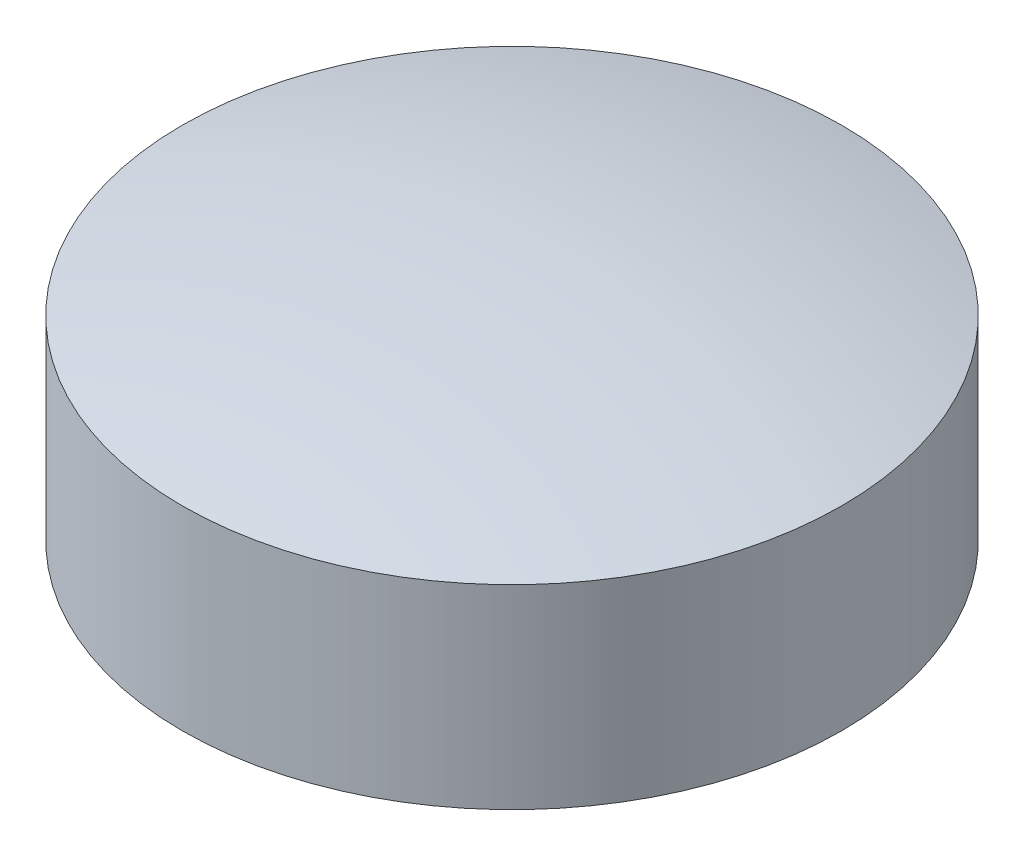
ISO-10303-21;
HEADER;
FILE_DESCRIPTION(('STEP AP214'),'2;1');
FILE_NAME('part.step','',(''),(''),'','','');
FILE_SCHEMA(('AUTOMOTIVE_DESIGN { 1 0 10303 214 1 1 1 1 }'));
ENDSEC;
DATA;
#1=APPLICATION_CONTEXT('core data for automotive mechanical design processes');
#2=APPLICATION_PROTOCOL_DEFINITION('international standard','automotive_design',2000,#1);
#3=PRODUCT_CONTEXT('',#1,'mechanical');
#4=PRODUCT('Part','Part','',(#3));
#5=PRODUCT_RELATED_PRODUCT_CATEGORY('part','',(#4));
#6=PRODUCT_DEFINITION_FORMATION('','',#4);
#7=PRODUCT_DEFINITION_CONTEXT('part definition',#1,'design');
#8=PRODUCT_DEFINITION('design','',#6,#7);
#9=PRODUCT_DEFINITION_SHAPE('','',#8);
#10=(LENGTH_UNIT() NAMED_UNIT(*) SI_UNIT(.MILLI.,.METRE.));
#11=(NAMED_UNIT(*) PLANE_ANGLE_UNIT() SI_UNIT($,.RADIAN.));
#12=(NAMED_UNIT(*) SI_UNIT($,.STERADIAN.) SOLID_ANGLE_UNIT());
#13=UNCERTAINTY_MEASURE_WITH_UNIT(LENGTH_MEASURE(1.E-05),#10,'distance_accuracy_value','');
#14=(GEOMETRIC_REPRESENTATION_CONTEXT(3) GLOBAL_UNCERTAINTY_ASSIGNED_CONTEXT((#13)) GLOBAL_UNIT_ASSIGNED_CONTEXT((#10,
#11,#12)) REPRESENTATION_CONTEXT('',''));
#15=CARTESIAN_POINT('',(0.,0.,0.));
#16=DIRECTION('',(0.,0.,1.));
#17=DIRECTION('',(1.,0.,0.));
#18=AXIS2_PLACEMENT_3D('',#15,#16,#17);
#19=CARTESIAN_POINT('',(0.,0.,0.));
#20=DIRECTION('',(0.,-1.,0.));
#21=DIRECTION('',(0.,0.,-1.));
#22=AXIS2_PLACEMENT_3D('',#19,#20,#21);
#23=CYLINDRICAL_SURFACE('',#22,22.);
#24=CARTESIAN_POINT('',(0.,13.,0.));
#25=DIRECTION('',(0.,-1.,0.));
#26=DIRECTION('',(0.,0.,-1.));
#27=AXIS2_PLACEMENT_3D('',#24,#25,#26);
#28=CIRCLE('',#27,22.);
#29=CARTESIAN_POINT('',(0.,13.,-22.));
#30=VERTEX_POINT('',#29);
#31=EDGE_CURVE('E57',#30,#30,#28,.T.);
#32=ORIENTED_EDGE('',*,*,#31,.T.);
#33=EDGE_LOOP('',(#32));
#34=FACE_BOUND('',#33,.T.);
#35=CARTESIAN_POINT('',(0.,0.,0.));
#36=DIRECTION('',(0.,-1.,0.));
#37=DIRECTION('',(0.,0.,-1.));
#38=AXIS2_PLACEMENT_3D('',#35,#36,#37);
#39=CIRCLE('',#38,22.);
#40=CARTESIAN_POINT('',(-21.9488636363636,0.,-1.49912810403717));
#41=VERTEX_POINT('',#40);
#42=CARTESIAN_POINT('',(-21.9488636363636,0.,1.49912810403716));
#43=VERTEX_POINT('',#42);
#44=EDGE_CURVE('E85',#41,#43,#39,.T.);
#45=ORIENTED_EDGE('',*,*,#44,.F.);
#46=DIRECTION('',(0.,-1.,0.));
#47=VECTOR('',#46,1.);
#48=CARTESIAN_POINT('',(-21.9488636363636,5.,-1.49912810403716));
#49=LINE('',#48,#47);
#50=CARTESIAN_POINT('',(-21.9488636363636,10.,-1.49912810403716));
#51=VERTEX_POINT('',#50);
#52=EDGE_CURVE('E64',#41,#51,#49,.F.);
#53=ORIENTED_EDGE('',*,*,#52,.T.);
#54=CARTESIAN_POINT('',(0.,10.,0.));
#55=DIRECTION('',(0.,1.,0.));
#56=DIRECTION('',(0.,0.,1.));
#57=AXIS2_PLACEMENT_3D('',#54,#55,#56);
#58=CIRCLE('',#57,22.);
#59=CARTESIAN_POINT('',(-21.9488636363636,10.,1.49912810403716));
#60=VERTEX_POINT('',#59);
#61=EDGE_CURVE('E13',#60,#51,#58,.F.);
#62=ORIENTED_EDGE('',*,*,#61,.F.);
#63=DIRECTION('',(0.,-1.,0.));
#64=VECTOR('',#63,1.);
#65=CARTESIAN_POINT('',(-21.9488636363636,5.,1.49912810403716));
#66=LINE('',#65,#64);
#67=EDGE_CURVE('E73',#60,#43,#66,.T.);
#68=ORIENTED_EDGE('',*,*,#67,.T.);
#69=EDGE_LOOP('',(#45,#53,#62,#68));
#70=FACE_BOUND('',#69,.T.);
#71=ADVANCED_FACE('F49',(#34,#70),#23,.T.);
#72=CARTESIAN_POINT('',(0.,-66.1666666666667,0.));
#73=DIRECTION('',(0.,-1.,0.));
#74=DIRECTION('',(1.,0.,0.));
#75=AXIS2_PLACEMENT_3D('',#72,#73,#74);
#76=SPHERICAL_SURFACE('',#75,82.1666666666667);
#77=ORIENTED_EDGE('',*,*,#31,.F.);
#78=EDGE_LOOP('',(#77));
#79=FACE_BOUND('',#78,.T.);
#80=ADVANCED_FACE('F51',(#79),#76,.T.);
#81=CARTESIAN_POINT('',(0.,0.,0.));
#82=DIRECTION('',(0.,-1.,0.));
#83=DIRECTION('',(0.,0.,-1.));
#84=AXIS2_PLACEMENT_3D('',#81,#82,#83);
#85=PLANE('',#84);
#86=ORIENTED_EDGE('',*,*,#44,.T.);
#87=CARTESIAN_POINT('',(-22.,0.,0.));
#88=DIRECTION('',(0.,1.,0.));
#89=DIRECTION('',(0.,0.,1.));
#90=AXIS2_PLACEMENT_3D('',#87,#88,#89);
#91=CIRCLE('',#90,1.5);
#92=EDGE_CURVE('E68',#43,#41,#91,.T.);
#93=ORIENTED_EDGE('',*,*,#92,.T.);
#94=EDGE_LOOP('',(#86,#93));
#95=FACE_BOUND('',#94,.T.);
#96=ADVANCED_FACE('F94',(#95),#85,.T.);
#97=CARTESIAN_POINT('',(-22.,10.,0.));
#98=DIRECTION('',(0.,-1.,0.));
#99=DIRECTION('',(0.,0.,-1.));
#100=AXIS2_PLACEMENT_3D('',#97,#98,#99);
#101=CYLINDRICAL_SURFACE('',#100,1.5);
#102=ORIENTED_EDGE('',*,*,#92,.F.);
#103=ORIENTED_EDGE('',*,*,#67,.F.);
#104=CARTESIAN_POINT('',(-22.,10.,0.));
#105=DIRECTION('',(0.,1.,0.));
#106=DIRECTION('',(0.,0.,1.));
#107=AXIS2_PLACEMENT_3D('',#104,#105,#106);
#108=CIRCLE('',#107,1.5);
#109=EDGE_CURVE('E76',#60,#51,#108,.T.);
#110=ORIENTED_EDGE('',*,*,#109,.T.);
#111=ORIENTED_EDGE('',*,*,#52,.F.);
#112=EDGE_LOOP('',(#102,#103,#110,#111));
#113=FACE_BOUND('',#112,.T.);
#114=ADVANCED_FACE('F75',(#113),#101,.F.);
#115=CARTESIAN_POINT('',(-22.,10.,0.));
#116=DIRECTION('',(0.,1.,0.));
#117=DIRECTION('',(0.,0.,1.));
#118=AXIS2_PLACEMENT_3D('',#115,#116,#117);
#119=PLANE('',#118);
#120=ORIENTED_EDGE('',*,*,#61,.T.);
#121=ORIENTED_EDGE('',*,*,#109,.F.);
#122=EDGE_LOOP('',(#120,#121));
#123=FACE_BOUND('',#122,.T.);
#124=ADVANCED_FACE('F83',(#123),#119,.F.);
#125=CLOSED_SHELL('',(#71,#80,#96,#114,#124));
#126=MANIFOLD_SOLID_BREP('B2',#125);
#127=ADVANCED_BREP_SHAPE_REPRESENTATION('',(#18,#126),#14);
#128=SHAPE_DEFINITION_REPRESENTATION(#9,#127);
ENDSEC;
END-ISO-10303-21;
